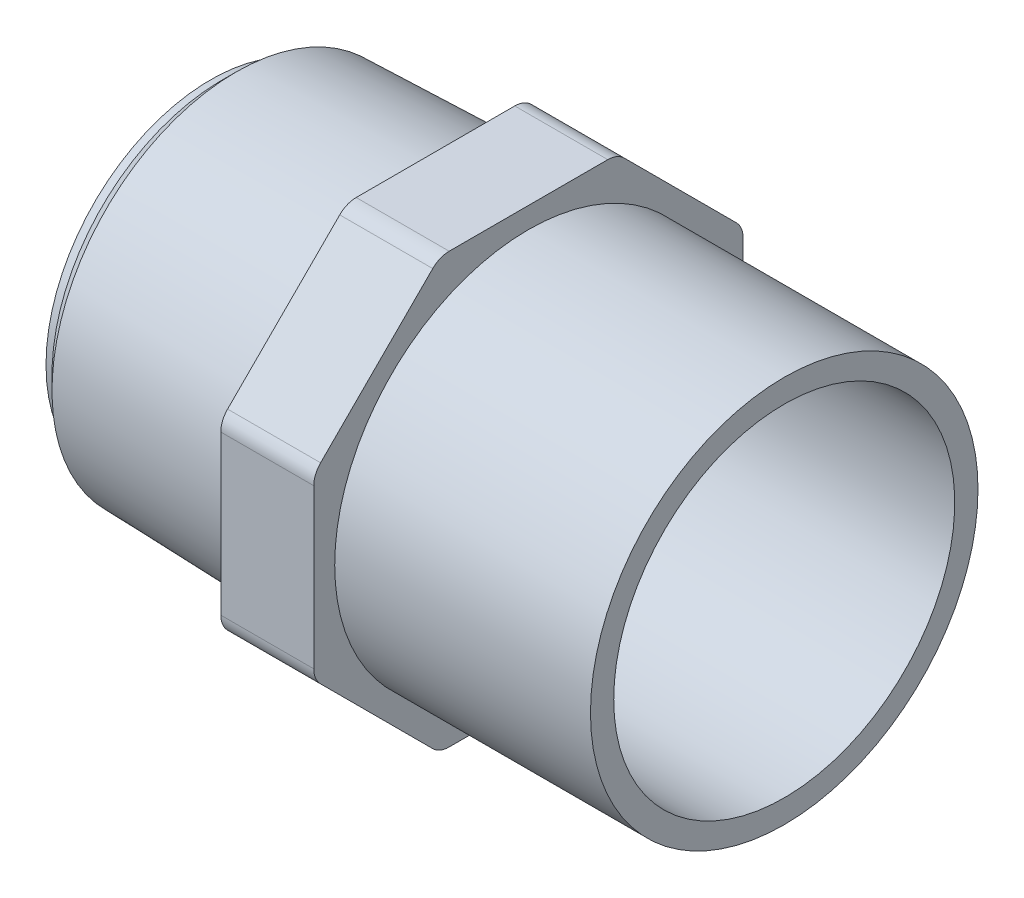
ISO-10303-21;
HEADER;
FILE_DESCRIPTION(('STEP AP214'),'2;1');
FILE_NAME('part.step','',(''),(''),'','','');
FILE_SCHEMA(('AUTOMOTIVE_DESIGN { 1 0 10303 214 1 1 1 1 }'));
ENDSEC;
DATA;
#1=APPLICATION_CONTEXT('core data for automotive mechanical design processes');
#2=APPLICATION_PROTOCOL_DEFINITION('international standard','automotive_design',2000,#1);
#3=PRODUCT_CONTEXT('',#1,'mechanical');
#4=PRODUCT('Part','Part','',(#3));
#5=PRODUCT_RELATED_PRODUCT_CATEGORY('part','',(#4));
#6=PRODUCT_DEFINITION_FORMATION('','',#4);
#7=PRODUCT_DEFINITION_CONTEXT('part definition',#1,'design');
#8=PRODUCT_DEFINITION('design','',#6,#7);
#9=PRODUCT_DEFINITION_SHAPE('','',#8);
#10=(LENGTH_UNIT() NAMED_UNIT(*) SI_UNIT(.MILLI.,.METRE.));
#11=(NAMED_UNIT(*) PLANE_ANGLE_UNIT() SI_UNIT($,.RADIAN.));
#12=(NAMED_UNIT(*) SI_UNIT($,.STERADIAN.) SOLID_ANGLE_UNIT());
#13=UNCERTAINTY_MEASURE_WITH_UNIT(LENGTH_MEASURE(1.E-05),#10,'distance_accuracy_value','');
#14=(GEOMETRIC_REPRESENTATION_CONTEXT(3) GLOBAL_UNCERTAINTY_ASSIGNED_CONTEXT((#13)) GLOBAL_UNIT_ASSIGNED_CONTEXT((#10,
#11,#12)) REPRESENTATION_CONTEXT('',''));
#15=CARTESIAN_POINT('',(0.,0.,0.));
#16=DIRECTION('',(0.,0.,1.));
#17=DIRECTION('',(1.,0.,0.));
#18=AXIS2_PLACEMENT_3D('',#15,#16,#17);
#19=CARTESIAN_POINT('',(-33.,-10.2310749906154,24.7));
#20=DIRECTION('',(1.,0.,0.));
#21=DIRECTION('',(0.,0.,-1.));
#22=AXIS2_PLACEMENT_3D('',#19,#20,#21);
#23=CYLINDRICAL_SURFACE('',#22,2.99999999999998);
#24=CARTESIAN_POINT('',(-45.,-10.2310749906154,24.7));
#25=DIRECTION('',(1.,0.,0.));
#26=DIRECTION('',(0.,0.,-1.));
#27=AXIS2_PLACEMENT_3D('',#24,#25,#26);
#28=CIRCLE('',#27,2.99999999999998);
#29=CARTESIAN_POINT('',(-45.,-12.3523953341751,26.8213203435596));
#30=VERTEX_POINT('',#29);
#31=CARTESIAN_POINT('',(-45.,-10.2310749906154,27.7));
#32=VERTEX_POINT('',#31);
#33=EDGE_CURVE('E18',#30,#32,#28,.F.);
#34=ORIENTED_EDGE('',*,*,#33,.F.);
#35=DIRECTION('',(1.,0.,0.));
#36=VECTOR('',#35,1.);
#37=CARTESIAN_POINT('',(-45.,-12.3523953341751,26.8213203435596));
#38=LINE('',#37,#36);
#39=CARTESIAN_POINT('',(-33.,-12.3523953341751,26.8213203435596));
#40=VERTEX_POINT('',#39);
#41=EDGE_CURVE('E263',#40,#30,#38,.F.);
#42=ORIENTED_EDGE('',*,*,#41,.F.);
#43=CARTESIAN_POINT('',(-33.,-10.2310749906154,24.7));
#44=DIRECTION('',(1.,0.,0.));
#45=DIRECTION('',(0.,0.,-1.));
#46=AXIS2_PLACEMENT_3D('',#43,#44,#45);
#47=CIRCLE('',#46,2.99999999999998);
#48=CARTESIAN_POINT('',(-33.,-10.2310749906154,27.7));
#49=VERTEX_POINT('',#48);
#50=EDGE_CURVE('E130',#49,#40,#47,.T.);
#51=ORIENTED_EDGE('',*,*,#50,.F.);
#52=DIRECTION('',(1.,0.,0.));
#53=VECTOR('',#52,1.);
#54=CARTESIAN_POINT('',(-45.,-10.2310749906154,27.7));
#55=LINE('',#54,#53);
#56=EDGE_CURVE('E127',#32,#49,#55,.T.);
#57=ORIENTED_EDGE('',*,*,#56,.F.);
#58=EDGE_LOOP('',(#34,#42,#51,#57));
#59=FACE_BOUND('',#58,.T.);
#60=ADVANCED_FACE('F15',(#59),#23,.T.);
#61=CARTESIAN_POINT('',(-45.,-12.3523953341751,26.8213203435596));
#62=DIRECTION('',(0.,-0.707106781186548,0.707106781186547));
#63=DIRECTION('',(0.,-0.707106781186547,-0.707106781186548));
#64=AXIS2_PLACEMENT_3D('',#61,#62,#63);
#65=PLANE('',#64);
#66=CARTESIAN_POINT('',(-45.,-26.8213203435596,12.3523953341751));
#67=CARTESIAN_POINT('',(-45.,-26.2184484681686,12.9552672095661));
#68=CARTESIAN_POINT('',(-45.,-25.6155765927776,13.5581390849571));
#69=CARTESIAN_POINT('',(-45.,-24.4098328419956,14.7638828357392));
#70=CARTESIAN_POINT('',(-45.,-23.8069609666045,15.3667547111302));
#71=CARTESIAN_POINT('',(-45.,-22.6012172158225,16.5724984619122));
#72=CARTESIAN_POINT('',(-45.,-21.9983453404315,17.1753703373033));
#73=CARTESIAN_POINT('',(-45.,-20.7926015896494,18.3811140880853));
#74=CARTESIAN_POINT('',(-45.,-20.1897297142584,18.9839859634763));
#75=CARTESIAN_POINT('',(-45.,-18.9839859634763,20.1897297142584));
#76=CARTESIAN_POINT('',(-45.,-18.3811140880853,20.7926015896494));
#77=CARTESIAN_POINT('',(-45.,-17.1753703373033,21.9983453404315));
#78=CARTESIAN_POINT('',(-45.,-16.5724984619123,22.6012172158225));
#79=CARTESIAN_POINT('',(-45.,-15.3667547111302,23.8069609666045));
#80=CARTESIAN_POINT('',(-45.,-14.7638828357392,24.4098328419956));
#81=CARTESIAN_POINT('',(-45.,-13.5581390849571,25.6155765927776));
#82=CARTESIAN_POINT('',(-45.,-12.9552672095661,26.2184484681686));
#83=CARTESIAN_POINT('',(-45.,-12.3523953341751,26.8213203435596));
#84=B_SPLINE_CURVE_WITH_KNOTS('',3,(#66,#67,#68,#69,#70,#71,#72,#73,#74,#75,#76,#77,#78,#79,#80,
#81,#82,#83),.UNSPECIFIED.,.F.,.F.,(4,2,2,2,2,2,2,2,4),(0.,2.55776874765387,5.11553749530773,
7.67330624296159,10.2310749906155,12.7888437382693,15.3466124859232,17.9043812335771,
20.4621499812309),.UNSPECIFIED.);
#85=CARTESIAN_POINT('',(-45.,-26.8213203435596,12.3523953341751));
#86=VERTEX_POINT('',#85);
#87=EDGE_CURVE('E145',#86,#30,#84,.T.);
#88=ORIENTED_EDGE('',*,*,#87,.F.);
#89=DIRECTION('',(-1.,0.,0.));
#90=VECTOR('',#89,1.);
#91=CARTESIAN_POINT('',(-39.,-26.8213203435596,12.3523953341751));
#92=LINE('',#91,#90);
#93=CARTESIAN_POINT('',(-33.,-26.8213203435596,12.3523953341751));
#94=VERTEX_POINT('',#93);
#95=EDGE_CURVE('E262',#94,#86,#92,.T.);
#96=ORIENTED_EDGE('',*,*,#95,.F.);
#97=CARTESIAN_POINT('',(-33.,-12.3523953341751,26.8213203435596));
#98=CARTESIAN_POINT('',(-33.,-12.9552672095661,26.2184484681686));
#99=CARTESIAN_POINT('',(-33.,-13.5581390849571,25.6155765927776));
#100=CARTESIAN_POINT('',(-33.,-14.7638828357392,24.4098328419955));
#101=CARTESIAN_POINT('',(-33.,-15.3667547111302,23.8069609666045));
#102=CARTESIAN_POINT('',(-33.,-16.5724984619122,22.6012172158225));
#103=CARTESIAN_POINT('',(-33.,-17.1753703373033,21.9983453404315));
#104=CARTESIAN_POINT('',(-33.,-18.3811140880853,20.7926015896494));
#105=CARTESIAN_POINT('',(-33.,-18.9839859634763,20.1897297142584));
#106=CARTESIAN_POINT('',(-33.,-20.1897297142584,18.9839859634763));
#107=CARTESIAN_POINT('',(-33.,-20.7926015896494,18.3811140880853));
#108=CARTESIAN_POINT('',(-33.,-21.9983453404315,17.1753703373033));
#109=CARTESIAN_POINT('',(-33.,-22.6012172158225,16.5724984619122));
#110=CARTESIAN_POINT('',(-33.,-23.8069609666045,15.3667547111302));
#111=CARTESIAN_POINT('',(-33.,-24.4098328419956,14.7638828357392));
#112=CARTESIAN_POINT('',(-33.,-25.6155765927776,13.5581390849571));
#113=CARTESIAN_POINT('',(-33.,-26.2184484681686,12.9552672095661));
#114=CARTESIAN_POINT('',(-33.,-26.8213203435596,12.3523953341751));
#115=B_SPLINE_CURVE_WITH_KNOTS('',3,(#97,#98,#99,#100,#101,#102,#103,#104,#105,#106,#107,#108,
#109,#110,#111,#112,#113,#114),.UNSPECIFIED.,.F.,.F.,(4,2,2,2,2,2,2,2,4),(0.,2.55776874765386,
5.11553749530772,7.67330624296159,10.2310749906155,12.7888437382693,15.3466124859232,
17.9043812335771,20.4621499812309),.UNSPECIFIED.);
#116=EDGE_CURVE('E151',#40,#94,#115,.T.);
#117=ORIENTED_EDGE('',*,*,#116,.F.);
#118=ORIENTED_EDGE('',*,*,#41,.T.);
#119=EDGE_LOOP('',(#88,#96,#117,#118));
#120=FACE_BOUND('',#119,.T.);
#121=ADVANCED_FACE('F267',(#120),#65,.T.);
#122=CARTESIAN_POINT('',(-33.,-24.7,10.2310749906154));
#123=DIRECTION('',(1.,0.,0.));
#124=DIRECTION('',(0.,0.,-1.));
#125=AXIS2_PLACEMENT_3D('',#122,#123,#124);
#126=CYLINDRICAL_SURFACE('',#125,2.99999999999998);
#127=CARTESIAN_POINT('',(-45.,-24.7,10.2310749906154));
#128=DIRECTION('',(1.,0.,0.));
#129=DIRECTION('',(0.,0.,-1.));
#130=AXIS2_PLACEMENT_3D('',#127,#128,#129);
#131=CIRCLE('',#130,2.99999999999998);
#132=CARTESIAN_POINT('',(-45.,-27.7,10.2310749906154));
#133=VERTEX_POINT('',#132);
#134=EDGE_CURVE('E148',#133,#86,#131,.F.);
#135=ORIENTED_EDGE('',*,*,#134,.F.);
#136=DIRECTION('',(1.,0.,0.));
#137=VECTOR('',#136,1.);
#138=CARTESIAN_POINT('',(-45.,-27.7,10.2310749906154));
#139=LINE('',#138,#137);
#140=CARTESIAN_POINT('',(-33.,-27.7,10.2310749906154));
#141=VERTEX_POINT('',#140);
#142=EDGE_CURVE('E257',#141,#133,#139,.F.);
#143=ORIENTED_EDGE('',*,*,#142,.F.);
#144=CARTESIAN_POINT('',(-33.,-24.7,10.2310749906154));
#145=DIRECTION('',(1.,0.,0.));
#146=DIRECTION('',(0.,0.,-1.));
#147=AXIS2_PLACEMENT_3D('',#144,#145,#146);
#148=CIRCLE('',#147,2.99999999999998);
#149=EDGE_CURVE('E261',#94,#141,#148,.T.);
#150=ORIENTED_EDGE('',*,*,#149,.F.);
#151=ORIENTED_EDGE('',*,*,#95,.T.);
#152=EDGE_LOOP('',(#135,#143,#150,#151));
#153=FACE_BOUND('',#152,.T.);
#154=ADVANCED_FACE('F544',(#153),#126,.T.);
#155=CARTESIAN_POINT('',(-45.,-27.7,10.2310749906154));
#156=DIRECTION('',(0.,-1.,0.));
#157=DIRECTION('',(0.,0.,-1.));
#158=AXIS2_PLACEMENT_3D('',#155,#156,#157);
#159=PLANE('',#158);
#160=DIRECTION('',(0.,0.,-1.));
#161=VECTOR('',#160,1.);
#162=CARTESIAN_POINT('',(-45.,-27.7,27.7));
#163=LINE('',#162,#161);
#164=CARTESIAN_POINT('',(-45.,-27.7,-10.2310749906155));
#165=VERTEX_POINT('',#164);
#166=EDGE_CURVE('E153',#165,#133,#163,.F.);
#167=ORIENTED_EDGE('',*,*,#166,.F.);
#168=DIRECTION('',(-1.,0.,0.));
#169=VECTOR('',#168,1.);
#170=CARTESIAN_POINT('',(-39.,-27.7,-10.2310749906155));
#171=LINE('',#170,#169);
#172=CARTESIAN_POINT('',(-33.,-27.7,-10.2310749906155));
#173=VERTEX_POINT('',#172);
#174=EDGE_CURVE('E255',#173,#165,#171,.T.);
#175=ORIENTED_EDGE('',*,*,#174,.F.);
#176=DIRECTION('',(0.,0.,-1.));
#177=VECTOR('',#176,1.);
#178=CARTESIAN_POINT('',(-33.,-27.7,27.7));
#179=LINE('',#178,#177);
#180=EDGE_CURVE('E258',#141,#173,#179,.T.);
#181=ORIENTED_EDGE('',*,*,#180,.F.);
#182=ORIENTED_EDGE('',*,*,#142,.T.);
#183=EDGE_LOOP('',(#167,#175,#181,#182));
#184=FACE_BOUND('',#183,.T.);
#185=ADVANCED_FACE('F536',(#184),#159,.T.);
#186=CARTESIAN_POINT('',(-33.,-24.7,-10.2310749906155));
#187=DIRECTION('',(1.,0.,0.));
#188=DIRECTION('',(0.,0.,-1.));
#189=AXIS2_PLACEMENT_3D('',#186,#187,#188);
#190=CYLINDRICAL_SURFACE('',#189,2.99999999999997);
#191=CARTESIAN_POINT('',(-45.,-24.7,-10.2310749906155));
#192=DIRECTION('',(1.,0.,0.));
#193=DIRECTION('',(0.,0.,-1.));
#194=AXIS2_PLACEMENT_3D('',#191,#192,#193);
#195=CIRCLE('',#194,2.99999999999997);
#196=CARTESIAN_POINT('',(-45.,-26.8213203435596,-12.3523953341751));
#197=VERTEX_POINT('',#196);
#198=EDGE_CURVE('E291',#197,#165,#195,.F.);
#199=ORIENTED_EDGE('',*,*,#198,.F.);
#200=DIRECTION('',(1.,0.,0.));
#201=VECTOR('',#200,1.);
#202=CARTESIAN_POINT('',(-45.,-26.8213203435596,-12.3523953341751));
#203=LINE('',#202,#201);
#204=CARTESIAN_POINT('',(-33.,-26.8213203435596,-12.3523953341751));
#205=VERTEX_POINT('',#204);
#206=EDGE_CURVE('E243',#205,#197,#203,.F.);
#207=ORIENTED_EDGE('',*,*,#206,.F.);
#208=CARTESIAN_POINT('',(-33.,-24.7,-10.2310749906155));
#209=DIRECTION('',(1.,0.,0.));
#210=DIRECTION('',(0.,0.,-1.));
#211=AXIS2_PLACEMENT_3D('',#208,#209,#210);
#212=CIRCLE('',#211,2.99999999999997);
#213=EDGE_CURVE('E248',#173,#205,#212,.T.);
#214=ORIENTED_EDGE('',*,*,#213,.F.);
#215=ORIENTED_EDGE('',*,*,#174,.T.);
#216=EDGE_LOOP('',(#199,#207,#214,#215));
#217=FACE_BOUND('',#216,.T.);
#218=ADVANCED_FACE('F528',(#217),#190,.T.);
#219=CARTESIAN_POINT('',(-45.,-26.8213203435596,-12.3523953341751));
#220=DIRECTION('',(0.,-0.707106781186547,-0.707106781186548));
#221=DIRECTION('',(0.,0.707106781186548,-0.707106781186547));
#222=AXIS2_PLACEMENT_3D('',#219,#220,#221);
#223=PLANE('',#222);
#224=CARTESIAN_POINT('',(-45.,-12.3523953341751,-26.8213203435596));
#225=CARTESIAN_POINT('',(-45.,-12.9552672095661,-26.2184484681686));
#226=CARTESIAN_POINT('',(-45.,-13.5581390849571,-25.6155765927776));
#227=CARTESIAN_POINT('',(-45.,-14.7638828357392,-24.4098328419955));
#228=CARTESIAN_POINT('',(-45.,-15.3667547111302,-23.8069609666045));
#229=CARTESIAN_POINT('',(-45.,-16.5724984619122,-22.6012172158225));
#230=CARTESIAN_POINT('',(-45.,-17.1753703373033,-21.9983453404315));
#231=CARTESIAN_POINT('',(-45.,-18.3811140880853,-20.7926015896494));
#232=CARTESIAN_POINT('',(-45.,-18.9839859634763,-20.1897297142584));
#233=CARTESIAN_POINT('',(-45.,-20.1897297142584,-18.9839859634763));
#234=CARTESIAN_POINT('',(-45.,-20.7926015896494,-18.3811140880853));
#235=CARTESIAN_POINT('',(-45.,-21.9983453404314,-17.1753703373033));
#236=CARTESIAN_POINT('',(-45.,-22.6012172158225,-16.5724984619123));
#237=CARTESIAN_POINT('',(-45.,-23.8069609666045,-15.3667547111302));
#238=CARTESIAN_POINT('',(-45.,-24.4098328419955,-14.7638828357392));
#239=CARTESIAN_POINT('',(-45.,-25.6155765927776,-13.5581390849571));
#240=CARTESIAN_POINT('',(-45.,-26.2184484681686,-12.9552672095661));
#241=CARTESIAN_POINT('',(-45.,-26.8213203435596,-12.3523953341751));
#242=B_SPLINE_CURVE_WITH_KNOTS('',3,(#224,#225,#226,#227,#228,#229,#230,#231,#232,#233,#234,
#235,#236,#237,#238,#239,#240,#241),.UNSPECIFIED.,.F.,.F.,(4,2,2,2,2,2,2,2,4),(0.,
2.55776874765386,5.11553749530772,7.67330624296158,10.2310749906154,12.7888437382693,
15.3466124859232,17.904381233577,20.4621499812309),.UNSPECIFIED.);
#243=CARTESIAN_POINT('',(-45.,-12.3523953341751,-26.8213203435596));
#244=VERTEX_POINT('',#243);
#245=EDGE_CURVE('E159',#244,#197,#242,.T.);
#246=ORIENTED_EDGE('',*,*,#245,.F.);
#247=DIRECTION('',(-1.,0.,0.));
#248=VECTOR('',#247,1.);
#249=CARTESIAN_POINT('',(-39.,-12.3523953341751,-26.8213203435596));
#250=LINE('',#249,#248);
#251=CARTESIAN_POINT('',(-33.,-12.3523953341751,-26.8213203435596));
#252=VERTEX_POINT('',#251);
#253=EDGE_CURVE('E242',#252,#244,#250,.T.);
#254=ORIENTED_EDGE('',*,*,#253,.F.);
#255=CARTESIAN_POINT('',(-33.,-26.8213203435596,-12.3523953341751));
#256=CARTESIAN_POINT('',(-33.,-26.2184484681686,-12.9552672095661));
#257=CARTESIAN_POINT('',(-33.,-25.6155765927776,-13.5581390849571));
#258=CARTESIAN_POINT('',(-33.,-24.4098328419955,-14.7638828357392));
#259=CARTESIAN_POINT('',(-33.,-23.8069609666045,-15.3667547111302));
#260=CARTESIAN_POINT('',(-33.,-22.6012172158225,-16.5724984619123));
#261=CARTESIAN_POINT('',(-33.,-21.9983453404314,-17.1753703373033));
#262=CARTESIAN_POINT('',(-33.,-20.7926015896494,-18.3811140880853));
#263=CARTESIAN_POINT('',(-33.,-20.1897297142584,-18.9839859634763));
#264=CARTESIAN_POINT('',(-33.,-18.9839859634763,-20.1897297142584));
#265=CARTESIAN_POINT('',(-33.,-18.3811140880853,-20.7926015896494));
#266=CARTESIAN_POINT('',(-33.,-17.1753703373033,-21.9983453404315));
#267=CARTESIAN_POINT('',(-33.,-16.5724984619122,-22.6012172158225));
#268=CARTESIAN_POINT('',(-33.,-15.3667547111302,-23.8069609666045));
#269=CARTESIAN_POINT('',(-33.,-14.7638828357392,-24.4098328419955));
#270=CARTESIAN_POINT('',(-33.,-13.5581390849571,-25.6155765927776));
#271=CARTESIAN_POINT('',(-33.,-12.9552672095661,-26.2184484681686));
#272=CARTESIAN_POINT('',(-33.,-12.3523953341751,-26.8213203435596));
#273=B_SPLINE_CURVE_WITH_KNOTS('',3,(#255,#256,#257,#258,#259,#260,#261,#262,#263,#264,#265,
#266,#267,#268,#269,#270,#271,#272),.UNSPECIFIED.,.F.,.F.,(4,2,2,2,2,2,2,2,4),(0.,
2.55776874765386,5.11553749530772,7.67330624296158,10.2310749906154,12.7888437382693,
15.3466124859232,17.904381233577,20.4621499812309),.UNSPECIFIED.);
#274=EDGE_CURVE('E244',#205,#252,#273,.T.);
#275=ORIENTED_EDGE('',*,*,#274,.F.);
#276=ORIENTED_EDGE('',*,*,#206,.T.);
#277=EDGE_LOOP('',(#246,#254,#275,#276));
#278=FACE_BOUND('',#277,.T.);
#279=ADVANCED_FACE('F520',(#278),#223,.T.);
#280=CARTESIAN_POINT('',(-33.,-10.2310749906154,-24.7));
#281=DIRECTION('',(1.,0.,0.));
#282=DIRECTION('',(0.,0.,-1.));
#283=AXIS2_PLACEMENT_3D('',#280,#281,#282);
#284=CYLINDRICAL_SURFACE('',#283,2.99999999999999);
#285=CARTESIAN_POINT('',(-45.,-10.2310749906154,-24.7));
#286=DIRECTION('',(1.,0.,0.));
#287=DIRECTION('',(0.,0.,-1.));
#288=AXIS2_PLACEMENT_3D('',#285,#286,#287);
#289=CIRCLE('',#288,2.99999999999999);
#290=CARTESIAN_POINT('',(-45.,-10.2310749906154,-27.7));
#291=VERTEX_POINT('',#290);
#292=EDGE_CURVE('E294',#291,#244,#289,.F.);
#293=ORIENTED_EDGE('',*,*,#292,.F.);
#294=DIRECTION('',(1.,0.,0.));
#295=VECTOR('',#294,1.);
#296=CARTESIAN_POINT('',(-45.,-10.2310749906154,-27.7));
#297=LINE('',#296,#295);
#298=CARTESIAN_POINT('',(-33.,-10.2310749906154,-27.7));
#299=VERTEX_POINT('',#298);
#300=EDGE_CURVE('E236',#299,#291,#297,.F.);
#301=ORIENTED_EDGE('',*,*,#300,.F.);
#302=CARTESIAN_POINT('',(-33.,-10.2310749906154,-24.7));
#303=DIRECTION('',(1.,0.,0.));
#304=DIRECTION('',(0.,0.,-1.));
#305=AXIS2_PLACEMENT_3D('',#302,#303,#304);
#306=CIRCLE('',#305,2.99999999999999);
#307=EDGE_CURVE('E240',#252,#299,#306,.T.);
#308=ORIENTED_EDGE('',*,*,#307,.F.);
#309=ORIENTED_EDGE('',*,*,#253,.T.);
#310=EDGE_LOOP('',(#293,#301,#308,#309));
#311=FACE_BOUND('',#310,.T.);
#312=ADVANCED_FACE('F512',(#311),#284,.T.);
#313=CARTESIAN_POINT('',(-45.,-10.2310749906154,-27.7));
#314=DIRECTION('',(0.,0.,-1.));
#315=DIRECTION('',(0.,1.,0.));
#316=AXIS2_PLACEMENT_3D('',#313,#314,#315);
#317=PLANE('',#316);
#318=DIRECTION('',(0.,-1.,0.));
#319=VECTOR('',#318,1.);
#320=CARTESIAN_POINT('',(-45.,0.,-27.7));
#321=LINE('',#320,#319);
#322=CARTESIAN_POINT('',(-45.,10.2310749906154,-27.7));
#323=VERTEX_POINT('',#322);
#324=EDGE_CURVE('E297',#323,#291,#321,.T.);
#325=ORIENTED_EDGE('',*,*,#324,.F.);
#326=DIRECTION('',(-1.,0.,0.));
#327=VECTOR('',#326,1.);
#328=CARTESIAN_POINT('',(-39.,10.2310749906154,-27.7));
#329=LINE('',#328,#327);
#330=CARTESIAN_POINT('',(-33.,10.2310749906154,-27.7));
#331=VERTEX_POINT('',#330);
#332=EDGE_CURVE('E234',#331,#323,#329,.T.);
#333=ORIENTED_EDGE('',*,*,#332,.F.);
#334=DIRECTION('',(0.,1.,0.));
#335=VECTOR('',#334,1.);
#336=CARTESIAN_POINT('',(-33.,0.,-27.7));
#337=LINE('',#336,#335);
#338=EDGE_CURVE('E237',#299,#331,#337,.T.);
#339=ORIENTED_EDGE('',*,*,#338,.F.);
#340=ORIENTED_EDGE('',*,*,#300,.T.);
#341=EDGE_LOOP('',(#325,#333,#339,#340));
#342=FACE_BOUND('',#341,.T.);
#343=ADVANCED_FACE('F504',(#342),#317,.T.);
#344=CARTESIAN_POINT('',(-33.,10.2310749906154,-24.7));
#345=DIRECTION('',(1.,0.,0.));
#346=DIRECTION('',(0.,0.,-1.));
#347=AXIS2_PLACEMENT_3D('',#344,#345,#346);
#348=CYLINDRICAL_SURFACE('',#347,3.00000000000003);
#349=CARTESIAN_POINT('',(-45.,10.2310749906154,-24.7));
#350=DIRECTION('',(1.,0.,0.));
#351=DIRECTION('',(0.,0.,-1.));
#352=AXIS2_PLACEMENT_3D('',#349,#350,#351);
#353=CIRCLE('',#352,3.00000000000003);
#354=CARTESIAN_POINT('',(-45.,12.3523953341751,-26.8213203435596));
#355=VERTEX_POINT('',#354);
#356=EDGE_CURVE('E298',#355,#323,#353,.F.);
#357=ORIENTED_EDGE('',*,*,#356,.F.);
#358=DIRECTION('',(1.,0.,0.));
#359=VECTOR('',#358,1.);
#360=CARTESIAN_POINT('',(-45.,12.3523953341751,-26.8213203435596));
#361=LINE('',#360,#359);
#362=CARTESIAN_POINT('',(-33.,12.3523953341751,-26.8213203435596));
#363=VERTEX_POINT('',#362);
#364=EDGE_CURVE('E227',#363,#355,#361,.F.);
#365=ORIENTED_EDGE('',*,*,#364,.F.);
#366=CARTESIAN_POINT('',(-33.,10.2310749906154,-24.7));
#367=DIRECTION('',(1.,0.,0.));
#368=DIRECTION('',(0.,0.,-1.));
#369=AXIS2_PLACEMENT_3D('',#366,#367,#368);
#370=CIRCLE('',#369,3.00000000000003);
#371=EDGE_CURVE('E224',#331,#363,#370,.T.);
#372=ORIENTED_EDGE('',*,*,#371,.F.);
#373=ORIENTED_EDGE('',*,*,#332,.T.);
#374=EDGE_LOOP('',(#357,#365,#372,#373));
#375=FACE_BOUND('',#374,.T.);
#376=ADVANCED_FACE('F496',(#375),#348,.T.);
#377=CARTESIAN_POINT('',(-45.,12.3523953341751,-26.8213203435596));
#378=DIRECTION('',(0.,0.707106781186548,-0.707106781186547));
#379=DIRECTION('',(0.,0.707106781186547,0.707106781186548));
#380=AXIS2_PLACEMENT_3D('',#377,#378,#379);
#381=PLANE('',#380);
#382=CARTESIAN_POINT('',(-45.,26.8213203435596,-12.3523953341751));
#383=CARTESIAN_POINT('',(-45.,26.2184484681686,-12.9552672095661));
#384=CARTESIAN_POINT('',(-45.,25.6155765927776,-13.5581390849571));
#385=CARTESIAN_POINT('',(-45.,24.4098328419955,-14.7638828357392));
#386=CARTESIAN_POINT('',(-45.,23.8069609666045,-15.3667547111302));
#387=CARTESIAN_POINT('',(-45.,22.6012172158225,-16.5724984619122));
#388=CARTESIAN_POINT('',(-45.,21.9983453404315,-17.1753703373033));
#389=CARTESIAN_POINT('',(-45.,20.7926015896494,-18.3811140880853));
#390=CARTESIAN_POINT('',(-45.,20.1897297142584,-18.9839859634763));
#391=CARTESIAN_POINT('',(-45.,18.9839859634763,-20.1897297142584));
#392=CARTESIAN_POINT('',(-45.,18.3811140880853,-20.7926015896494));
#393=CARTESIAN_POINT('',(-45.,17.1753703373033,-21.9983453404314));
#394=CARTESIAN_POINT('',(-45.,16.5724984619123,-22.6012172158225));
#395=CARTESIAN_POINT('',(-45.,15.3667547111302,-23.8069609666045));
#396=CARTESIAN_POINT('',(-45.,14.7638828357392,-24.4098328419955));
#397=CARTESIAN_POINT('',(-45.,13.5581390849571,-25.6155765927776));
#398=CARTESIAN_POINT('',(-45.,12.9552672095661,-26.2184484681686));
#399=CARTESIAN_POINT('',(-45.,12.3523953341751,-26.8213203435596));
#400=B_SPLINE_CURVE_WITH_KNOTS('',3,(#382,#383,#384,#385,#386,#387,#388,#389,#390,#391,#392,
#393,#394,#395,#396,#397,#398,#399),.UNSPECIFIED.,.F.,.F.,(4,2,2,2,2,2,2,2,4),(0.,
2.55776874765386,5.11553749530771,7.67330624296157,10.2310749906154,12.7888437382693,
15.3466124859232,17.904381233577,20.4621499812309),.UNSPECIFIED.);
#401=CARTESIAN_POINT('',(-45.,26.8213203435596,-12.3523953341751));
#402=VERTEX_POINT('',#401);
#403=EDGE_CURVE('E301',#402,#355,#400,.T.);
#404=ORIENTED_EDGE('',*,*,#403,.F.);
#405=DIRECTION('',(-1.,0.,0.));
#406=VECTOR('',#405,1.);
#407=CARTESIAN_POINT('',(-39.,26.8213203435596,-12.3523953341751));
#408=LINE('',#407,#406);
#409=CARTESIAN_POINT('',(-33.,26.8213203435596,-12.3523953341751));
#410=VERTEX_POINT('',#409);
#411=EDGE_CURVE('E225',#410,#402,#408,.T.);
#412=ORIENTED_EDGE('',*,*,#411,.F.);
#413=CARTESIAN_POINT('',(-33.,12.3523953341751,-26.8213203435596));
#414=CARTESIAN_POINT('',(-33.,12.9552672095661,-26.2184484681686));
#415=CARTESIAN_POINT('',(-33.,13.5581390849571,-25.6155765927776));
#416=CARTESIAN_POINT('',(-33.,14.7638828357392,-24.4098328419955));
#417=CARTESIAN_POINT('',(-33.,15.3667547111302,-23.8069609666045));
#418=CARTESIAN_POINT('',(-33.,16.5724984619123,-22.6012172158225));
#419=CARTESIAN_POINT('',(-33.,17.1753703373033,-21.9983453404314));
#420=CARTESIAN_POINT('',(-33.,18.3811140880853,-20.7926015896494));
#421=CARTESIAN_POINT('',(-33.,18.9839859634763,-20.1897297142584));
#422=CARTESIAN_POINT('',(-33.,20.1897297142584,-18.9839859634763));
#423=CARTESIAN_POINT('',(-33.,20.7926015896494,-18.3811140880853));
#424=CARTESIAN_POINT('',(-33.,21.9983453404315,-17.1753703373033));
#425=CARTESIAN_POINT('',(-33.,22.6012172158225,-16.5724984619122));
#426=CARTESIAN_POINT('',(-33.,23.8069609666045,-15.3667547111302));
#427=CARTESIAN_POINT('',(-33.,24.4098328419955,-14.7638828357392));
#428=CARTESIAN_POINT('',(-33.,25.6155765927776,-13.5581390849571));
#429=CARTESIAN_POINT('',(-33.,26.2184484681686,-12.9552672095661));
#430=CARTESIAN_POINT('',(-33.,26.8213203435596,-12.3523953341751));
#431=B_SPLINE_CURVE_WITH_KNOTS('',3,(#413,#414,#415,#416,#417,#418,#419,#420,#421,#422,#423,
#424,#425,#426,#427,#428,#429,#430),.UNSPECIFIED.,.F.,.F.,(4,2,2,2,2,2,2,2,4),(0.,
2.55776874765386,5.11553749530772,7.67330624296158,10.2310749906154,12.7888437382693,
15.3466124859232,17.904381233577,20.4621499812309),.UNSPECIFIED.);
#432=EDGE_CURVE('E218',#363,#410,#431,.T.);
#433=ORIENTED_EDGE('',*,*,#432,.F.);
#434=ORIENTED_EDGE('',*,*,#364,.T.);
#435=EDGE_LOOP('',(#404,#412,#433,#434));
#436=FACE_BOUND('',#435,.T.);
#437=ADVANCED_FACE('F488',(#436),#381,.T.);
#438=CARTESIAN_POINT('',(-33.,24.7,-10.2310749906154));
#439=DIRECTION('',(1.,0.,0.));
#440=DIRECTION('',(0.,0.,-1.));
#441=AXIS2_PLACEMENT_3D('',#438,#439,#440);
#442=CYLINDRICAL_SURFACE('',#441,3.);
#443=CARTESIAN_POINT('',(-45.,24.7,-10.2310749906154));
#444=DIRECTION('',(1.,0.,0.));
#445=DIRECTION('',(0.,0.,-1.));
#446=AXIS2_PLACEMENT_3D('',#443,#444,#445);
#447=CIRCLE('',#446,3.);
#448=CARTESIAN_POINT('',(-45.,27.7,-10.2310749906154));
#449=VERTEX_POINT('',#448);
#450=EDGE_CURVE('E302',#449,#402,#447,.F.);
#451=ORIENTED_EDGE('',*,*,#450,.F.);
#452=DIRECTION('',(1.,0.,0.));
#453=VECTOR('',#452,1.);
#454=CARTESIAN_POINT('',(-45.,27.7,-10.2310749906154));
#455=LINE('',#454,#453);
#456=CARTESIAN_POINT('',(-33.,27.7,-10.2310749906154));
#457=VERTEX_POINT('',#456);
#458=EDGE_CURVE('E584',#457,#449,#455,.F.);
#459=ORIENTED_EDGE('',*,*,#458,.F.);
#460=CARTESIAN_POINT('',(-33.,24.7,-10.2310749906154));
#461=DIRECTION('',(1.,0.,0.));
#462=DIRECTION('',(0.,0.,-1.));
#463=AXIS2_PLACEMENT_3D('',#460,#461,#462);
#464=CIRCLE('',#463,3.);
#465=EDGE_CURVE('E223',#410,#457,#464,.T.);
#466=ORIENTED_EDGE('',*,*,#465,.F.);
#467=ORIENTED_EDGE('',*,*,#411,.T.);
#468=EDGE_LOOP('',(#451,#459,#466,#467));
#469=FACE_BOUND('',#468,.T.);
#470=ADVANCED_FACE('F480',(#469),#442,.T.);
#471=CARTESIAN_POINT('',(-45.,27.7,-10.2310749906154));
#472=DIRECTION('',(0.,1.,0.));
#473=DIRECTION('',(0.,0.,1.));
#474=AXIS2_PLACEMENT_3D('',#471,#472,#473);
#475=PLANE('',#474);
#476=DIRECTION('',(0.,0.,-1.));
#477=VECTOR('',#476,1.);
#478=CARTESIAN_POINT('',(-45.,27.7,27.7));
#479=LINE('',#478,#477);
#480=CARTESIAN_POINT('',(-45.,27.7,10.2310749906155));
#481=VERTEX_POINT('',#480);
#482=EDGE_CURVE('E305',#481,#449,#479,.T.);
#483=ORIENTED_EDGE('',*,*,#482,.F.);
#484=DIRECTION('',(-1.,0.,0.));
#485=VECTOR('',#484,1.);
#486=CARTESIAN_POINT('',(-39.,27.7,10.2310749906154));
#487=LINE('',#486,#485);
#488=CARTESIAN_POINT('',(-33.,27.7,10.2310749906155));
#489=VERTEX_POINT('',#488);
#490=EDGE_CURVE('E587',#489,#481,#487,.T.);
#491=ORIENTED_EDGE('',*,*,#490,.F.);
#492=DIRECTION('',(0.,0.,-1.));
#493=VECTOR('',#492,1.);
#494=CARTESIAN_POINT('',(-33.,27.7,27.7));
#495=LINE('',#494,#493);
#496=EDGE_CURVE('E281',#457,#489,#495,.F.);
#497=ORIENTED_EDGE('',*,*,#496,.F.);
#498=ORIENTED_EDGE('',*,*,#458,.T.);
#499=EDGE_LOOP('',(#483,#491,#497,#498));
#500=FACE_BOUND('',#499,.T.);
#501=ADVANCED_FACE('F472',(#500),#475,.T.);
#502=CARTESIAN_POINT('',(-33.,24.7,10.2310749906155));
#503=DIRECTION('',(1.,0.,0.));
#504=DIRECTION('',(0.,0.,-1.));
#505=AXIS2_PLACEMENT_3D('',#502,#503,#504);
#506=CYLINDRICAL_SURFACE('',#505,2.99999999999998);
#507=CARTESIAN_POINT('',(-45.,24.7,10.2310749906155));
#508=DIRECTION('',(1.,0.,0.));
#509=DIRECTION('',(0.,0.,-1.));
#510=AXIS2_PLACEMENT_3D('',#507,#508,#509);
#511=CIRCLE('',#510,2.99999999999998);
#512=CARTESIAN_POINT('',(-45.,26.8213203435596,12.3523953341751));
#513=VERTEX_POINT('',#512);
#514=EDGE_CURVE('E306',#513,#481,#511,.F.);
#515=ORIENTED_EDGE('',*,*,#514,.F.);
#516=DIRECTION('',(1.,0.,0.));
#517=VECTOR('',#516,1.);
#518=CARTESIAN_POINT('',(-45.,26.8213203435596,12.3523953341751));
#519=LINE('',#518,#517);
#520=CARTESIAN_POINT('',(-33.,26.8213203435596,12.3523953341751));
#521=VERTEX_POINT('',#520);
#522=EDGE_CURVE('E191',#521,#513,#519,.F.);
#523=ORIENTED_EDGE('',*,*,#522,.F.);
#524=CARTESIAN_POINT('',(-33.,24.7,10.2310749906155));
#525=DIRECTION('',(1.,0.,0.));
#526=DIRECTION('',(0.,0.,-1.));
#527=AXIS2_PLACEMENT_3D('',#524,#525,#526);
#528=CIRCLE('',#527,2.99999999999998);
#529=EDGE_CURVE('E197',#489,#521,#528,.T.);
#530=ORIENTED_EDGE('',*,*,#529,.F.);
#531=ORIENTED_EDGE('',*,*,#490,.T.);
#532=EDGE_LOOP('',(#515,#523,#530,#531));
#533=FACE_BOUND('',#532,.T.);
#534=ADVANCED_FACE('F464',(#533),#506,.T.);
#535=CARTESIAN_POINT('',(-45.,26.8213203435596,12.3523953341751));
#536=DIRECTION('',(0.,0.707106781186548,0.707106781186547));
#537=DIRECTION('',(0.,-0.707106781186547,0.707106781186548));
#538=AXIS2_PLACEMENT_3D('',#535,#536,#537);
#539=PLANE('',#538);
#540=CARTESIAN_POINT('',(-45.,12.3523953341751,26.8213203435596));
#541=CARTESIAN_POINT('',(-45.,12.9552672095661,26.2184484681686));
#542=CARTESIAN_POINT('',(-45.,13.5581390849571,25.6155765927776));
#543=CARTESIAN_POINT('',(-45.,14.7638828357392,24.4098328419956));
#544=CARTESIAN_POINT('',(-45.,15.3667547111302,23.8069609666045));
#545=CARTESIAN_POINT('',(-45.,16.5724984619122,22.6012172158225));
#546=CARTESIAN_POINT('',(-45.,17.1753703373033,21.9983453404315));
#547=CARTESIAN_POINT('',(-45.,18.3811140880853,20.7926015896494));
#548=CARTESIAN_POINT('',(-45.,18.9839859634763,20.1897297142584));
#549=CARTESIAN_POINT('',(-45.,20.1897297142584,18.9839859634764));
#550=CARTESIAN_POINT('',(-45.,20.7926015896494,18.3811140880853));
#551=CARTESIAN_POINT('',(-45.,21.9983453404314,17.1753703373033));
#552=CARTESIAN_POINT('',(-45.,22.6012172158225,16.5724984619123));
#553=CARTESIAN_POINT('',(-45.,23.8069609666045,15.3667547111302));
#554=CARTESIAN_POINT('',(-45.,24.4098328419955,14.7638828357392));
#555=CARTESIAN_POINT('',(-45.,25.6155765927776,13.5581390849571));
#556=CARTESIAN_POINT('',(-45.,26.2184484681686,12.9552672095661));
#557=CARTESIAN_POINT('',(-45.,26.8213203435596,12.3523953341751));
#558=B_SPLINE_CURVE_WITH_KNOTS('',3,(#540,#541,#542,#543,#544,#545,#546,#547,#548,#549,#550,
#551,#552,#553,#554,#555,#556,#557),.UNSPECIFIED.,.F.,.F.,(4,2,2,2,2,2,2,2,4),(0.,
2.55776874765386,5.11553749530772,7.67330624296158,10.2310749906154,12.7888437382693,
15.3466124859232,17.904381233577,20.4621499812309),.UNSPECIFIED.);
#559=CARTESIAN_POINT('',(-45.,12.3523953341751,26.8213203435596));
#560=VERTEX_POINT('',#559);
#561=EDGE_CURVE('E308',#560,#513,#558,.T.);
#562=ORIENTED_EDGE('',*,*,#561,.F.);
#563=DIRECTION('',(-1.,0.,0.));
#564=VECTOR('',#563,1.);
#565=CARTESIAN_POINT('',(-39.,12.3523953341751,26.8213203435596));
#566=LINE('',#565,#564);
#567=CARTESIAN_POINT('',(-33.,12.3523953341751,26.8213203435596));
#568=VERTEX_POINT('',#567);
#569=EDGE_CURVE('E186',#568,#560,#566,.T.);
#570=ORIENTED_EDGE('',*,*,#569,.F.);
#571=CARTESIAN_POINT('',(-33.,26.8213203435596,12.3523953341751));
#572=CARTESIAN_POINT('',(-33.,26.2184484681686,12.9552672095661));
#573=CARTESIAN_POINT('',(-33.,25.6155765927776,13.5581390849571));
#574=CARTESIAN_POINT('',(-33.,24.4098328419955,14.7638828357392));
#575=CARTESIAN_POINT('',(-33.,23.8069609666045,15.3667547111302));
#576=CARTESIAN_POINT('',(-33.,22.6012172158225,16.5724984619123));
#577=CARTESIAN_POINT('',(-33.,21.9983453404314,17.1753703373033));
#578=CARTESIAN_POINT('',(-33.,20.7926015896494,18.3811140880853));
#579=CARTESIAN_POINT('',(-33.,20.1897297142584,18.9839859634764));
#580=CARTESIAN_POINT('',(-33.,18.9839859634763,20.1897297142584));
#581=CARTESIAN_POINT('',(-33.,18.3811140880853,20.7926015896494));
#582=CARTESIAN_POINT('',(-33.,17.1753703373033,21.9983453404315));
#583=CARTESIAN_POINT('',(-33.,16.5724984619122,22.6012172158225));
#584=CARTESIAN_POINT('',(-33.,15.3667547111302,23.8069609666045));
#585=CARTESIAN_POINT('',(-33.,14.7638828357392,24.4098328419956));
#586=CARTESIAN_POINT('',(-33.,13.5581390849571,25.6155765927776));
#587=CARTESIAN_POINT('',(-33.,12.9552672095661,26.2184484681686));
#588=CARTESIAN_POINT('',(-33.,12.3523953341751,26.8213203435596));
#589=B_SPLINE_CURVE_WITH_KNOTS('',3,(#571,#572,#573,#574,#575,#576,#577,#578,#579,#580,#581,
#582,#583,#584,#585,#586,#587,#588),.UNSPECIFIED.,.F.,.F.,(4,2,2,2,2,2,2,2,4),(0.,
2.55776874765386,5.11553749530772,7.67330624296158,10.2310749906154,12.7888437382693,
15.3466124859232,17.904381233577,20.4621499812309),.UNSPECIFIED.);
#590=EDGE_CURVE('E192',#521,#568,#589,.T.);
#591=ORIENTED_EDGE('',*,*,#590,.F.);
#592=ORIENTED_EDGE('',*,*,#522,.T.);
#593=EDGE_LOOP('',(#562,#570,#591,#592));
#594=FACE_BOUND('',#593,.T.);
#595=ADVANCED_FACE('F457',(#594),#539,.T.);
#596=CARTESIAN_POINT('',(-33.,10.2310749906154,24.7));
#597=DIRECTION('',(1.,0.,0.));
#598=DIRECTION('',(0.,0.,-1.));
#599=AXIS2_PLACEMENT_3D('',#596,#597,#598);
#600=CYLINDRICAL_SURFACE('',#599,2.99999999999998);
#601=CARTESIAN_POINT('',(-45.,10.2310749906154,24.7));
#602=DIRECTION('',(1.,0.,0.));
#603=DIRECTION('',(0.,0.,-1.));
#604=AXIS2_PLACEMENT_3D('',#601,#602,#603);
#605=CIRCLE('',#604,2.99999999999998);
#606=CARTESIAN_POINT('',(-45.,10.2310749906154,27.7));
#607=VERTEX_POINT('',#606);
#608=EDGE_CURVE('E139',#607,#560,#605,.F.);
#609=ORIENTED_EDGE('',*,*,#608,.F.);
#610=DIRECTION('',(1.,0.,0.));
#611=VECTOR('',#610,1.);
#612=CARTESIAN_POINT('',(-45.,10.2310749906154,27.7));
#613=LINE('',#612,#611);
#614=CARTESIAN_POINT('',(-33.,10.2310749906154,27.7));
#615=VERTEX_POINT('',#614);
#616=EDGE_CURVE('E33',#615,#607,#613,.F.);
#617=ORIENTED_EDGE('',*,*,#616,.F.);
#618=CARTESIAN_POINT('',(-33.,10.2310749906154,24.7));
#619=DIRECTION('',(1.,0.,0.));
#620=DIRECTION('',(0.,0.,-1.));
#621=AXIS2_PLACEMENT_3D('',#618,#619,#620);
#622=CIRCLE('',#621,2.99999999999998);
#623=EDGE_CURVE('E196',#568,#615,#622,.T.);
#624=ORIENTED_EDGE('',*,*,#623,.F.);
#625=ORIENTED_EDGE('',*,*,#569,.T.);
#626=EDGE_LOOP('',(#609,#617,#624,#625));
#627=FACE_BOUND('',#626,.T.);
#628=ADVANCED_FACE('F360',(#627),#600,.T.);
#629=CARTESIAN_POINT('',(-45.,10.2310749906154,27.7));
#630=DIRECTION('',(0.,0.,1.));
#631=DIRECTION('',(0.,-1.,0.));
#632=AXIS2_PLACEMENT_3D('',#629,#630,#631);
#633=PLANE('',#632);
#634=DIRECTION('',(0.,1.,0.));
#635=VECTOR('',#634,1.);
#636=CARTESIAN_POINT('',(-45.,0.,27.7));
#637=LINE('',#636,#635);
#638=EDGE_CURVE('E135',#32,#607,#637,.T.);
#639=ORIENTED_EDGE('',*,*,#638,.F.);
#640=ORIENTED_EDGE('',*,*,#56,.T.);
#641=DIRECTION('',(0.,-1.,0.));
#642=VECTOR('',#641,1.);
#643=CARTESIAN_POINT('',(-33.,0.,27.7));
#644=LINE('',#643,#642);
#645=EDGE_CURVE('E198',#615,#49,#644,.T.);
#646=ORIENTED_EDGE('',*,*,#645,.F.);
#647=ORIENTED_EDGE('',*,*,#616,.T.);
#648=EDGE_LOOP('',(#639,#640,#646,#647));
#649=FACE_BOUND('',#648,.T.);
#650=ADVANCED_FACE('F136',(#649),#633,.T.);
#651=CARTESIAN_POINT('',(-45.,-27.7,27.7));
#652=DIRECTION('',(-1.,0.,0.));
#653=DIRECTION('',(0.,1.,0.));
#654=AXIS2_PLACEMENT_3D('',#651,#652,#653);
#655=PLANE('',#654);
#656=CARTESIAN_POINT('',(-45.,0.,0.));
#657=DIRECTION('',(1.,0.,0.));
#658=DIRECTION('',(0.,0.,-1.));
#659=AXIS2_PLACEMENT_3D('',#656,#657,#658);
#660=CIRCLE('',#659,24.5530926874423);
#661=CARTESIAN_POINT('',(-45.,0.,-24.5530926874423));
#662=VERTEX_POINT('',#661);
#663=EDGE_CURVE('E272',#662,#662,#660,.F.);
#664=ORIENTED_EDGE('',*,*,#663,.F.);
#665=EDGE_LOOP('',(#664));
#666=FACE_BOUND('',#665,.T.);
#667=ORIENTED_EDGE('',*,*,#134,.T.);
#668=ORIENTED_EDGE('',*,*,#87,.T.);
#669=ORIENTED_EDGE('',*,*,#33,.T.);
#670=ORIENTED_EDGE('',*,*,#638,.T.);
#671=ORIENTED_EDGE('',*,*,#608,.T.);
#672=ORIENTED_EDGE('',*,*,#561,.T.);
#673=ORIENTED_EDGE('',*,*,#514,.T.);
#674=ORIENTED_EDGE('',*,*,#482,.T.);
#675=ORIENTED_EDGE('',*,*,#450,.T.);
#676=ORIENTED_EDGE('',*,*,#403,.T.);
#677=ORIENTED_EDGE('',*,*,#356,.T.);
#678=ORIENTED_EDGE('',*,*,#324,.T.);
#679=ORIENTED_EDGE('',*,*,#292,.T.);
#680=ORIENTED_EDGE('',*,*,#245,.T.);
#681=ORIENTED_EDGE('',*,*,#198,.T.);
#682=ORIENTED_EDGE('',*,*,#166,.T.);
#683=EDGE_LOOP('',(#667,#668,#669,#670,#671,#672,#673,#674,#675,#676,#677,#678,#679,#680,#681,#682));
#684=FACE_BOUND('',#683,.T.);
#685=ADVANCED_FACE('F143',(#666,#684),#655,.T.);
#686=CARTESIAN_POINT('',(-33.,27.7,27.7));
#687=DIRECTION('',(1.,0.,0.));
#688=DIRECTION('',(0.,-1.,0.));
#689=AXIS2_PLACEMENT_3D('',#686,#687,#688);
#690=PLANE('',#689);
#691=CARTESIAN_POINT('',(-33.,0.,0.));
#692=DIRECTION('',(-1.,0.,0.));
#693=DIRECTION('',(0.,0.,1.));
#694=AXIS2_PLACEMENT_3D('',#691,#692,#693);
#695=CIRCLE('',#694,25.);
#696=CARTESIAN_POINT('',(-33.,0.,25.));
#697=VERTEX_POINT('',#696);
#698=EDGE_CURVE('E274',#697,#697,#695,.F.);
#699=ORIENTED_EDGE('',*,*,#698,.F.);
#700=EDGE_LOOP('',(#699));
#701=FACE_BOUND('',#700,.T.);
#702=ORIENTED_EDGE('',*,*,#623,.T.);
#703=ORIENTED_EDGE('',*,*,#645,.T.);
#704=ORIENTED_EDGE('',*,*,#50,.T.);
#705=ORIENTED_EDGE('',*,*,#116,.T.);
#706=ORIENTED_EDGE('',*,*,#149,.T.);
#707=ORIENTED_EDGE('',*,*,#180,.T.);
#708=ORIENTED_EDGE('',*,*,#213,.T.);
#709=ORIENTED_EDGE('',*,*,#274,.T.);
#710=ORIENTED_EDGE('',*,*,#307,.T.);
#711=ORIENTED_EDGE('',*,*,#338,.T.);
#712=ORIENTED_EDGE('',*,*,#371,.T.);
#713=ORIENTED_EDGE('',*,*,#432,.T.);
#714=ORIENTED_EDGE('',*,*,#465,.T.);
#715=ORIENTED_EDGE('',*,*,#496,.T.);
#716=ORIENTED_EDGE('',*,*,#529,.T.);
#717=ORIENTED_EDGE('',*,*,#590,.T.);
#718=EDGE_LOOP('',(#702,#703,#704,#705,#706,#707,#708,#709,#710,#711,#712,#713,#714,#715,#716,#717));
#719=FACE_BOUND('',#718,.T.);
#720=ADVANCED_FACE('F171',(#701,#719),#690,.T.);
#721=CARTESIAN_POINT('',(-70.7230979570329,0.,0.));
#722=DIRECTION('',(1.,0.,0.));
#723=DIRECTION('',(0.,0.,-1.));
#724=AXIS2_PLACEMENT_3D('',#721,#722,#723);
#725=CONICAL_SURFACE('',#724,23.7519020429671,0.0311366738555789);
#726=CARTESIAN_POINT('',(-70.7230979570329,0.,0.));
#727=DIRECTION('',(-1.,0.,0.));
#728=DIRECTION('',(0.,1.,0.));
#729=AXIS2_PLACEMENT_3D('',#726,#727,#728);
#730=CIRCLE('',#729,23.7519020429671);
#731=CARTESIAN_POINT('',(-70.7230979570329,23.7519020429671,0.));
#732=VERTEX_POINT('',#731);
#733=EDGE_CURVE('E339',#732,#732,#730,.T.);
#734=ORIENTED_EDGE('',*,*,#733,.F.);
#735=EDGE_LOOP('',(#734));
#736=FACE_BOUND('',#735,.T.);
#737=ORIENTED_EDGE('',*,*,#663,.T.);
#738=EDGE_LOOP('',(#737));
#739=FACE_BOUND('',#738,.T.);
#740=ADVANCED_FACE('F207',(#736,#739),#725,.T.);
#741=CARTESIAN_POINT('',(-33.,0.,0.));
#742=DIRECTION('',(-1.,0.,0.));
#743=DIRECTION('',(0.,0.,1.));
#744=AXIS2_PLACEMENT_3D('',#741,#742,#743);
#745=CYLINDRICAL_SURFACE('',#744,25.);
#746=ORIENTED_EDGE('',*,*,#698,.T.);
#747=EDGE_LOOP('',(#746));
#748=FACE_BOUND('',#747,.T.);
#749=CARTESIAN_POINT('',(0.,0.,0.));
#750=DIRECTION('',(-1.,0.,0.));
#751=DIRECTION('',(0.,0.,1.));
#752=AXIS2_PLACEMENT_3D('',#749,#750,#751);
#753=CIRCLE('',#752,25.);
#754=CARTESIAN_POINT('',(0.,0.,25.));
#755=VERTEX_POINT('',#754);
#756=EDGE_CURVE('E337',#755,#755,#753,.F.);
#757=ORIENTED_EDGE('',*,*,#756,.F.);
#758=EDGE_LOOP('',(#757));
#759=FACE_BOUND('',#758,.T.);
#760=ADVANCED_FACE('F350',(#748,#759),#745,.T.);
#761=CARTESIAN_POINT('',(-72.55,0.,0.));
#762=DIRECTION('',(1.,0.,0.));
#763=DIRECTION('',(0.,0.,-1.));
#764=AXIS2_PLACEMENT_3D('',#761,#762,#763);
#765=CONICAL_SURFACE('',#764,21.925,0.78539816339744);
#766=CARTESIAN_POINT('',(-72.55,0.,0.));
#767=DIRECTION('',(1.,0.,0.));
#768=DIRECTION('',(0.,0.,-1.));
#769=AXIS2_PLACEMENT_3D('',#766,#767,#768);
#770=CIRCLE('',#769,21.925);
#771=CARTESIAN_POINT('',(-72.55,0.,-21.925));
#772=VERTEX_POINT('',#771);
#773=EDGE_CURVE('E334',#772,#772,#770,.F.);
#774=ORIENTED_EDGE('',*,*,#773,.F.);
#775=EDGE_LOOP('',(#774));
#776=FACE_BOUND('',#775,.T.);
#777=ORIENTED_EDGE('',*,*,#733,.T.);
#778=EDGE_LOOP('',(#777));
#779=FACE_BOUND('',#778,.T.);
#780=ADVANCED_FACE('F346',(#776,#779),#765,.T.);
#781=CARTESIAN_POINT('',(0.,25.,25.3000021082717));
#782=DIRECTION('',(1.,0.,0.));
#783=DIRECTION('',(0.,-1.,0.));
#784=AXIS2_PLACEMENT_3D('',#781,#782,#783);
#785=PLANE('',#784);
#786=CARTESIAN_POINT('',(0.,0.,0.));
#787=DIRECTION('',(-1.,0.,0.));
#788=DIRECTION('',(0.,0.,1.));
#789=AXIS2_PLACEMENT_3D('',#786,#787,#788);
#790=CIRCLE('',#789,22.);
#791=CARTESIAN_POINT('',(0.,0.,22.));
#792=VERTEX_POINT('',#791);
#793=EDGE_CURVE('E331',#792,#792,#790,.F.);
#794=ORIENTED_EDGE('',*,*,#793,.F.);
#795=EDGE_LOOP('',(#794));
#796=FACE_BOUND('',#795,.T.);
#797=ORIENTED_EDGE('',*,*,#756,.T.);
#798=EDGE_LOOP('',(#797));
#799=FACE_BOUND('',#798,.T.);
#800=ADVANCED_FACE('F388',(#796,#799),#785,.T.);
#801=CARTESIAN_POINT('',(-72.55,-21.925,22.1881021083244));
#802=DIRECTION('',(-1.,0.,0.));
#803=DIRECTION('',(0.,1.,0.));
#804=AXIS2_PLACEMENT_3D('',#801,#802,#803);
#805=PLANE('',#804);
#806=CARTESIAN_POINT('',(-72.55,0.,0.));
#807=DIRECTION('',(-1.,0.,0.));
#808=DIRECTION('',(0.,0.,1.));
#809=AXIS2_PLACEMENT_3D('',#806,#807,#808);
#810=CIRCLE('',#809,21.25);
#811=CARTESIAN_POINT('',(-72.55,0.,21.25));
#812=VERTEX_POINT('',#811);
#813=EDGE_CURVE('E328',#812,#812,#810,.T.);
#814=ORIENTED_EDGE('',*,*,#813,.F.);
#815=EDGE_LOOP('',(#814));
#816=FACE_BOUND('',#815,.T.);
#817=ORIENTED_EDGE('',*,*,#773,.T.);
#818=EDGE_LOOP('',(#817));
#819=FACE_BOUND('',#818,.T.);
#820=ADVANCED_FACE('F384',(#816,#819),#805,.T.);
#821=CARTESIAN_POINT('',(0.,0.,0.));
#822=DIRECTION('',(-1.,0.,0.));
#823=DIRECTION('',(0.,0.,1.));
#824=AXIS2_PLACEMENT_3D('',#821,#822,#823);
#825=CYLINDRICAL_SURFACE('',#824,22.);
#826=ORIENTED_EDGE('',*,*,#793,.T.);
#827=EDGE_LOOP('',(#826));
#828=FACE_BOUND('',#827,.T.);
#829=CARTESIAN_POINT('',(-45.,0.,0.));
#830=DIRECTION('',(-1.,0.,0.));
#831=DIRECTION('',(0.,0.,1.));
#832=AXIS2_PLACEMENT_3D('',#829,#830,#831);
#833=CIRCLE('',#832,22.);
#834=CARTESIAN_POINT('',(-45.,0.,22.));
#835=VERTEX_POINT('',#834);
#836=EDGE_CURVE('E325',#835,#835,#833,.F.);
#837=ORIENTED_EDGE('',*,*,#836,.F.);
#838=EDGE_LOOP('',(#837));
#839=FACE_BOUND('',#838,.T.);
#840=ADVANCED_FACE('F380',(#828,#839),#825,.F.);
#841=CARTESIAN_POINT('',(-74.,0.,0.));
#842=DIRECTION('',(-1.,0.,0.));
#843=DIRECTION('',(0.,0.,1.));
#844=AXIS2_PLACEMENT_3D('',#841,#842,#843);
#845=CYLINDRICAL_SURFACE('',#844,21.25);
#846=CARTESIAN_POINT('',(-74.,0.,0.));
#847=DIRECTION('',(-1.,0.,0.));
#848=DIRECTION('',(0.,0.,1.));
#849=AXIS2_PLACEMENT_3D('',#846,#847,#848);
#850=CIRCLE('',#849,21.25);
#851=CARTESIAN_POINT('',(-74.,0.,21.25));
#852=VERTEX_POINT('',#851);
#853=EDGE_CURVE('E322',#852,#852,#850,.T.);
#854=ORIENTED_EDGE('',*,*,#853,.F.);
#855=EDGE_LOOP('',(#854));
#856=FACE_BOUND('',#855,.T.);
#857=ORIENTED_EDGE('',*,*,#813,.T.);
#858=EDGE_LOOP('',(#857));
#859=FACE_BOUND('',#858,.T.);
#860=ADVANCED_FACE('F376',(#856,#859),#845,.T.);
#861=CARTESIAN_POINT('',(-45.,22.,22.2640021085101));
#862=DIRECTION('',(1.,0.,0.));
#863=DIRECTION('',(0.,-1.,0.));
#864=AXIS2_PLACEMENT_3D('',#861,#862,#863);
#865=PLANE('',#864);
#866=CARTESIAN_POINT('',(-45.,0.,0.));
#867=DIRECTION('',(-1.,0.,0.));
#868=DIRECTION('',(0.,0.,1.));
#869=AXIS2_PLACEMENT_3D('',#866,#867,#868);
#870=CIRCLE('',#869,19.);
#871=CARTESIAN_POINT('',(-45.,0.,19.));
#872=VERTEX_POINT('',#871);
#873=EDGE_CURVE('E24',#872,#872,#870,.F.);
#874=ORIENTED_EDGE('',*,*,#873,.F.);
#875=EDGE_LOOP('',(#874));
#876=FACE_BOUND('',#875,.T.);
#877=ORIENTED_EDGE('',*,*,#836,.T.);
#878=EDGE_LOOP('',(#877));
#879=FACE_BOUND('',#878,.T.);
#880=ADVANCED_FACE('F369',(#876,#879),#865,.T.);
#881=CARTESIAN_POINT('',(-74.,-21.25,21.5050021083262));
#882=DIRECTION('',(-1.,0.,0.));
#883=DIRECTION('',(0.,1.,0.));
#884=AXIS2_PLACEMENT_3D('',#881,#882,#883);
#885=PLANE('',#884);
#886=CARTESIAN_POINT('',(-74.,0.,0.));
#887=DIRECTION('',(-1.,0.,0.));
#888=DIRECTION('',(0.,0.,1.));
#889=AXIS2_PLACEMENT_3D('',#886,#887,#888);
#890=CIRCLE('',#889,19.);
#891=CARTESIAN_POINT('',(-74.,0.,19.));
#892=VERTEX_POINT('',#891);
#893=EDGE_CURVE('E9',#892,#892,#890,.T.);
#894=ORIENTED_EDGE('',*,*,#893,.F.);
#895=EDGE_LOOP('',(#894));
#896=FACE_BOUND('',#895,.T.);
#897=ORIENTED_EDGE('',*,*,#853,.T.);
#898=EDGE_LOOP('',(#897));
#899=FACE_BOUND('',#898,.T.);
#900=ADVANCED_FACE('F363',(#896,#899),#885,.T.);
#901=CARTESIAN_POINT('',(-45.,0.,0.));
#902=DIRECTION('',(-1.,0.,0.));
#903=DIRECTION('',(0.,0.,1.));
#904=AXIS2_PLACEMENT_3D('',#901,#902,#903);
#905=CYLINDRICAL_SURFACE('',#904,19.);
#906=ORIENTED_EDGE('',*,*,#873,.T.);
#907=EDGE_LOOP('',(#906));
#908=FACE_BOUND('',#907,.T.);
#909=ORIENTED_EDGE('',*,*,#893,.T.);
#910=EDGE_LOOP('',(#909));
#911=FACE_BOUND('',#910,.T.);
#912=ADVANCED_FACE('F361',(#908,#911),#905,.F.);
#913=CLOSED_SHELL('',(#60,#121,#154,#185,#218,#279,#312,#343,#376,#437,#470,#501,#534,#595,#628,
#650,#685,#720,#740,#760,#780,#800,#820,#840,#860,#880,#900,#912));
#914=MANIFOLD_SOLID_BREP('B1',#913);
#915=ADVANCED_BREP_SHAPE_REPRESENTATION('',(#18,#914),#14);
#916=SHAPE_DEFINITION_REPRESENTATION(#9,#915);
ENDSEC;
END-ISO-10303-21;
